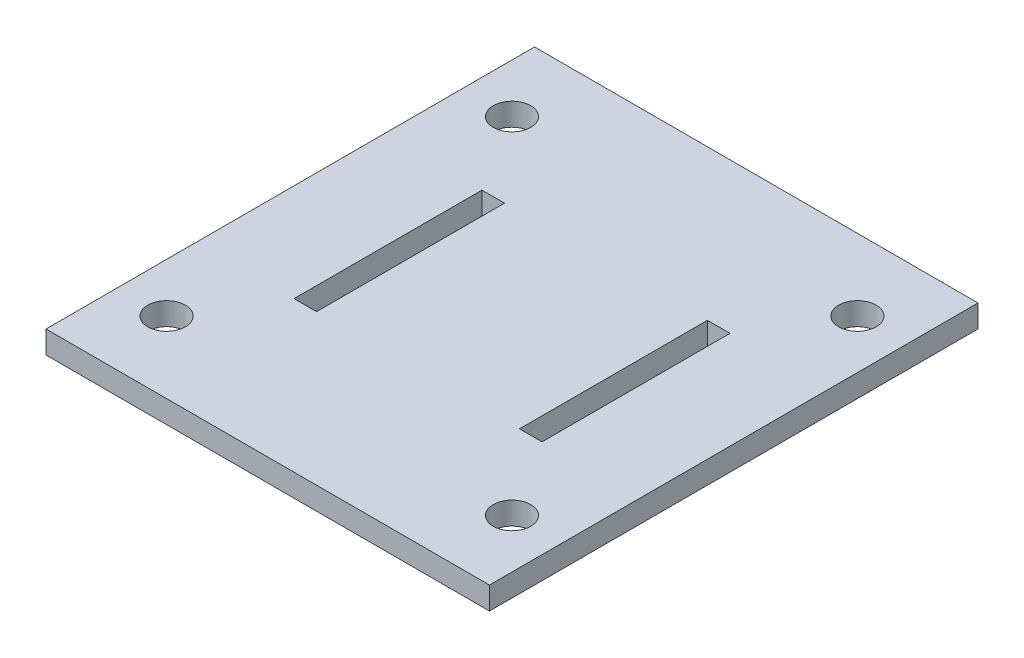
ISO-10303-21;
HEADER;
FILE_DESCRIPTION(('STEP AP214'),'2;1');
FILE_NAME('part.step','',(''),(''),'','','');
FILE_SCHEMA(('AUTOMOTIVE_DESIGN { 1 0 10303 214 1 1 1 1 }'));
ENDSEC;
DATA;
#1=APPLICATION_CONTEXT('core data for automotive mechanical design processes');
#2=APPLICATION_PROTOCOL_DEFINITION('international standard','automotive_design',2000,#1);
#3=PRODUCT_CONTEXT('',#1,'mechanical');
#4=PRODUCT('Part','Part','',(#3));
#5=PRODUCT_RELATED_PRODUCT_CATEGORY('part','',(#4));
#6=PRODUCT_DEFINITION_FORMATION('','',#4);
#7=PRODUCT_DEFINITION_CONTEXT('part definition',#1,'design');
#8=PRODUCT_DEFINITION('design','',#6,#7);
#9=PRODUCT_DEFINITION_SHAPE('','',#8);
#10=(LENGTH_UNIT() NAMED_UNIT(*) SI_UNIT(.MILLI.,.METRE.));
#11=(NAMED_UNIT(*) PLANE_ANGLE_UNIT() SI_UNIT($,.RADIAN.));
#12=(NAMED_UNIT(*) SI_UNIT($,.STERADIAN.) SOLID_ANGLE_UNIT());
#13=UNCERTAINTY_MEASURE_WITH_UNIT(LENGTH_MEASURE(1.E-05),#10,'distance_accuracy_value','');
#14=(GEOMETRIC_REPRESENTATION_CONTEXT(3) GLOBAL_UNCERTAINTY_ASSIGNED_CONTEXT((#13)) GLOBAL_UNIT_ASSIGNED_CONTEXT((#10,
#11,#12)) REPRESENTATION_CONTEXT('',''));
#15=CARTESIAN_POINT('',(0.,0.,0.));
#16=DIRECTION('',(0.,0.,1.));
#17=DIRECTION('',(1.,0.,0.));
#18=AXIS2_PLACEMENT_3D('',#15,#16,#17);
#19=CARTESIAN_POINT('',(29.5,3.,0.));
#20=DIRECTION('',(-1.,0.,0.));
#21=DIRECTION('',(0.,0.,1.));
#22=AXIS2_PLACEMENT_3D('',#19,#20,#21);
#23=PLANE('',#22);
#24=DIRECTION('',(0.,0.,-1.));
#25=VECTOR('',#24,1.);
#26=CARTESIAN_POINT('',(29.5,0.,0.));
#27=LINE('',#26,#25);
#28=CARTESIAN_POINT('',(29.5,0.,32.5));
#29=VERTEX_POINT('',#28);
#30=CARTESIAN_POINT('',(29.5,0.,-32.5));
#31=VERTEX_POINT('',#30);
#32=EDGE_CURVE('E192',#29,#31,#27,.T.);
#33=ORIENTED_EDGE('',*,*,#32,.T.);
#34=DIRECTION('',(0.,-1.,0.));
#35=VECTOR('',#34,1.);
#36=CARTESIAN_POINT('',(29.5,3.,-32.5));
#37=LINE('',#36,#35);
#38=CARTESIAN_POINT('',(29.5,3.,-32.5));
#39=VERTEX_POINT('',#38);
#40=EDGE_CURVE('E11',#39,#31,#37,.T.);
#41=ORIENTED_EDGE('',*,*,#40,.F.);
#42=DIRECTION('',(0.,0.,-1.));
#43=VECTOR('',#42,1.);
#44=CARTESIAN_POINT('',(29.5,3.,0.));
#45=LINE('',#44,#43);
#46=CARTESIAN_POINT('',(29.5,3.,32.5));
#47=VERTEX_POINT('',#46);
#48=EDGE_CURVE('E147',#47,#39,#45,.T.);
#49=ORIENTED_EDGE('',*,*,#48,.F.);
#50=DIRECTION('',(0.,-1.,0.));
#51=VECTOR('',#50,1.);
#52=CARTESIAN_POINT('',(29.5,3.,32.5));
#53=LINE('',#52,#51);
#54=EDGE_CURVE('E199',#47,#29,#53,.T.);
#55=ORIENTED_EDGE('',*,*,#54,.T.);
#56=EDGE_LOOP('',(#33,#41,#49,#55));
#57=FACE_BOUND('',#56,.T.);
#58=ADVANCED_FACE('F35',(#57),#23,.F.);
#59=CARTESIAN_POINT('',(0.,3.,-32.5));
#60=DIRECTION('',(0.,0.,-1.));
#61=DIRECTION('',(-1.,0.,0.));
#62=AXIS2_PLACEMENT_3D('',#59,#60,#61);
#63=PLANE('',#62);
#64=DIRECTION('',(1.,0.,0.));
#65=VECTOR('',#64,1.);
#66=CARTESIAN_POINT('',(0.,0.,-32.5));
#67=LINE('',#66,#65);
#68=CARTESIAN_POINT('',(-29.5,0.,-32.5));
#69=VERTEX_POINT('',#68);
#70=EDGE_CURVE('E139',#69,#31,#67,.T.);
#71=ORIENTED_EDGE('',*,*,#70,.F.);
#72=DIRECTION('',(0.,-1.,0.));
#73=VECTOR('',#72,1.);
#74=CARTESIAN_POINT('',(-29.5,3.,-32.5));
#75=LINE('',#74,#73);
#76=CARTESIAN_POINT('',(-29.5,3.,-32.5));
#77=VERTEX_POINT('',#76);
#78=EDGE_CURVE('E45',#77,#69,#75,.T.);
#79=ORIENTED_EDGE('',*,*,#78,.F.);
#80=DIRECTION('',(1.,0.,0.));
#81=VECTOR('',#80,1.);
#82=CARTESIAN_POINT('',(0.,3.,-32.5));
#83=LINE('',#82,#81);
#84=EDGE_CURVE('E137',#77,#39,#83,.T.);
#85=ORIENTED_EDGE('',*,*,#84,.T.);
#86=ORIENTED_EDGE('',*,*,#40,.T.);
#87=EDGE_LOOP('',(#71,#79,#85,#86));
#88=FACE_BOUND('',#87,.T.);
#89=ADVANCED_FACE('F135',(#88),#63,.T.);
#90=CARTESIAN_POINT('',(-29.5,3.,0.));
#91=DIRECTION('',(1.,0.,0.));
#92=DIRECTION('',(0.,0.,-1.));
#93=AXIS2_PLACEMENT_3D('',#90,#91,#92);
#94=PLANE('',#93);
#95=DIRECTION('',(0.,0.,1.));
#96=VECTOR('',#95,1.);
#97=CARTESIAN_POINT('',(-29.5,0.,0.));
#98=LINE('',#97,#96);
#99=CARTESIAN_POINT('',(-29.5,0.,32.5));
#100=VERTEX_POINT('',#99);
#101=EDGE_CURVE('E93',#69,#100,#98,.T.);
#102=ORIENTED_EDGE('',*,*,#101,.T.);
#103=DIRECTION('',(0.,-1.,0.));
#104=VECTOR('',#103,1.);
#105=CARTESIAN_POINT('',(-29.5,3.,32.5));
#106=LINE('',#105,#104);
#107=CARTESIAN_POINT('',(-29.5,3.,32.5));
#108=VERTEX_POINT('',#107);
#109=EDGE_CURVE('E140',#108,#100,#106,.T.);
#110=ORIENTED_EDGE('',*,*,#109,.F.);
#111=DIRECTION('',(0.,0.,1.));
#112=VECTOR('',#111,1.);
#113=CARTESIAN_POINT('',(-29.5,3.,0.));
#114=LINE('',#113,#112);
#115=EDGE_CURVE('E142',#77,#108,#114,.T.);
#116=ORIENTED_EDGE('',*,*,#115,.F.);
#117=ORIENTED_EDGE('',*,*,#78,.T.);
#118=EDGE_LOOP('',(#102,#110,#116,#117));
#119=FACE_BOUND('',#118,.T.);
#120=ADVANCED_FACE('F143',(#119),#94,.F.);
#121=CARTESIAN_POINT('',(16.5,3.,0.));
#122=DIRECTION('',(-1.,0.,0.));
#123=DIRECTION('',(0.,0.,1.));
#124=AXIS2_PLACEMENT_3D('',#121,#122,#123);
#125=PLANE('',#124);
#126=DIRECTION('',(0.,0.,-1.));
#127=VECTOR('',#126,1.);
#128=CARTESIAN_POINT('',(16.5,0.,0.));
#129=LINE('',#128,#127);
#130=CARTESIAN_POINT('',(16.5,0.,12.5));
#131=VERTEX_POINT('',#130);
#132=CARTESIAN_POINT('',(16.5,0.,-12.5));
#133=VERTEX_POINT('',#132);
#134=EDGE_CURVE('E180',#131,#133,#129,.T.);
#135=ORIENTED_EDGE('',*,*,#134,.F.);
#136=DIRECTION('',(0.,-1.,0.));
#137=VECTOR('',#136,1.);
#138=CARTESIAN_POINT('',(16.5,3.,12.5));
#139=LINE('',#138,#137);
#140=CARTESIAN_POINT('',(16.5,3.,12.5));
#141=VERTEX_POINT('',#140);
#142=EDGE_CURVE('E201',#141,#131,#139,.T.);
#143=ORIENTED_EDGE('',*,*,#142,.F.);
#144=DIRECTION('',(0.,0.,-1.));
#145=VECTOR('',#144,1.);
#146=CARTESIAN_POINT('',(16.5,3.,0.));
#147=LINE('',#146,#145);
#148=CARTESIAN_POINT('',(16.5,3.,-12.5));
#149=VERTEX_POINT('',#148);
#150=EDGE_CURVE('E237',#141,#149,#147,.T.);
#151=ORIENTED_EDGE('',*,*,#150,.T.);
#152=DIRECTION('',(0.,-1.,0.));
#153=VECTOR('',#152,1.);
#154=CARTESIAN_POINT('',(16.5,3.,-12.5));
#155=LINE('',#154,#153);
#156=EDGE_CURVE('E203',#149,#133,#155,.T.);
#157=ORIENTED_EDGE('',*,*,#156,.T.);
#158=EDGE_LOOP('',(#135,#143,#151,#157));
#159=FACE_BOUND('',#158,.T.);
#160=ADVANCED_FACE('F261',(#159),#125,.T.);
#161=CARTESIAN_POINT('',(0.,3.,12.5));
#162=DIRECTION('',(0.,0.,-1.));
#163=DIRECTION('',(-1.,0.,0.));
#164=AXIS2_PLACEMENT_3D('',#161,#162,#163);
#165=PLANE('',#164);
#166=DIRECTION('',(1.,0.,0.));
#167=VECTOR('',#166,1.);
#168=CARTESIAN_POINT('',(0.,0.,12.5));
#169=LINE('',#168,#167);
#170=CARTESIAN_POINT('',(13.5,0.,12.5));
#171=VERTEX_POINT('',#170);
#172=EDGE_CURVE('E183',#171,#131,#169,.T.);
#173=ORIENTED_EDGE('',*,*,#172,.F.);
#174=DIRECTION('',(0.,-1.,0.));
#175=VECTOR('',#174,1.);
#176=CARTESIAN_POINT('',(13.5,3.,12.5));
#177=LINE('',#176,#175);
#178=CARTESIAN_POINT('',(13.5,3.,12.5));
#179=VERTEX_POINT('',#178);
#180=EDGE_CURVE('E208',#179,#171,#177,.T.);
#181=ORIENTED_EDGE('',*,*,#180,.F.);
#182=DIRECTION('',(1.,0.,0.));
#183=VECTOR('',#182,1.);
#184=CARTESIAN_POINT('',(0.,3.,12.5));
#185=LINE('',#184,#183);
#186=EDGE_CURVE('E247',#179,#141,#185,.T.);
#187=ORIENTED_EDGE('',*,*,#186,.T.);
#188=ORIENTED_EDGE('',*,*,#142,.T.);
#189=EDGE_LOOP('',(#173,#181,#187,#188));
#190=FACE_BOUND('',#189,.T.);
#191=ADVANCED_FACE('F264',(#190),#165,.T.);
#192=CARTESIAN_POINT('',(13.5,3.,0.));
#193=DIRECTION('',(-1.,0.,0.));
#194=DIRECTION('',(0.,0.,1.));
#195=AXIS2_PLACEMENT_3D('',#192,#193,#194);
#196=PLANE('',#195);
#197=DIRECTION('',(0.,0.,-1.));
#198=VECTOR('',#197,1.);
#199=CARTESIAN_POINT('',(13.5,0.,0.));
#200=LINE('',#199,#198);
#201=CARTESIAN_POINT('',(13.5,0.,-12.5));
#202=VERTEX_POINT('',#201);
#203=EDGE_CURVE('E186',#171,#202,#200,.T.);
#204=ORIENTED_EDGE('',*,*,#203,.T.);
#205=DIRECTION('',(0.,-1.,0.));
#206=VECTOR('',#205,1.);
#207=CARTESIAN_POINT('',(13.5,3.,-12.5));
#208=LINE('',#207,#206);
#209=CARTESIAN_POINT('',(13.5,3.,-12.5));
#210=VERTEX_POINT('',#209);
#211=EDGE_CURVE('E205',#210,#202,#208,.T.);
#212=ORIENTED_EDGE('',*,*,#211,.F.);
#213=DIRECTION('',(0.,0.,-1.));
#214=VECTOR('',#213,1.);
#215=CARTESIAN_POINT('',(13.5,3.,0.));
#216=LINE('',#215,#214);
#217=EDGE_CURVE('E250',#179,#210,#216,.T.);
#218=ORIENTED_EDGE('',*,*,#217,.F.);
#219=ORIENTED_EDGE('',*,*,#180,.T.);
#220=EDGE_LOOP('',(#204,#212,#218,#219));
#221=FACE_BOUND('',#220,.T.);
#222=ADVANCED_FACE('F267',(#221),#196,.F.);
#223=CARTESIAN_POINT('',(-13.5,3.,0.));
#224=DIRECTION('',(-1.,0.,0.));
#225=DIRECTION('',(0.,0.,1.));
#226=AXIS2_PLACEMENT_3D('',#223,#224,#225);
#227=PLANE('',#226);
#228=DIRECTION('',(0.,0.,-1.));
#229=VECTOR('',#228,1.);
#230=CARTESIAN_POINT('',(-13.5,0.,0.));
#231=LINE('',#230,#229);
#232=CARTESIAN_POINT('',(-13.5,0.,12.5));
#233=VERTEX_POINT('',#232);
#234=CARTESIAN_POINT('',(-13.5,0.,-12.5));
#235=VERTEX_POINT('',#234);
#236=EDGE_CURVE('E168',#233,#235,#231,.T.);
#237=ORIENTED_EDGE('',*,*,#236,.F.);
#238=DIRECTION('',(0.,-1.,0.));
#239=VECTOR('',#238,1.);
#240=CARTESIAN_POINT('',(-13.5,3.,12.5));
#241=LINE('',#240,#239);
#242=CARTESIAN_POINT('',(-13.5,3.,12.5));
#243=VERTEX_POINT('',#242);
#244=EDGE_CURVE('E39',#243,#233,#241,.T.);
#245=ORIENTED_EDGE('',*,*,#244,.F.);
#246=DIRECTION('',(0.,0.,-1.));
#247=VECTOR('',#246,1.);
#248=CARTESIAN_POINT('',(-13.5,3.,0.));
#249=LINE('',#248,#247);
#250=CARTESIAN_POINT('',(-13.5,3.,-12.5));
#251=VERTEX_POINT('',#250);
#252=EDGE_CURVE('E241',#243,#251,#249,.T.);
#253=ORIENTED_EDGE('',*,*,#252,.T.);
#254=DIRECTION('',(0.,-1.,0.));
#255=VECTOR('',#254,1.);
#256=CARTESIAN_POINT('',(-13.5,3.,-12.5));
#257=LINE('',#256,#255);
#258=EDGE_CURVE('E155',#251,#235,#257,.T.);
#259=ORIENTED_EDGE('',*,*,#258,.T.);
#260=EDGE_LOOP('',(#237,#245,#253,#259));
#261=FACE_BOUND('',#260,.T.);
#262=ADVANCED_FACE('F224',(#261),#227,.T.);
#263=CARTESIAN_POINT('',(0.,3.,12.5));
#264=DIRECTION('',(0.,0.,-1.));
#265=DIRECTION('',(-1.,0.,0.));
#266=AXIS2_PLACEMENT_3D('',#263,#264,#265);
#267=PLANE('',#266);
#268=DIRECTION('',(1.,0.,0.));
#269=VECTOR('',#268,1.);
#270=CARTESIAN_POINT('',(0.,0.,12.5));
#271=LINE('',#270,#269);
#272=CARTESIAN_POINT('',(-16.5,0.,12.5));
#273=VERTEX_POINT('',#272);
#274=EDGE_CURVE('E171',#273,#233,#271,.T.);
#275=ORIENTED_EDGE('',*,*,#274,.F.);
#276=DIRECTION('',(0.,-1.,0.));
#277=VECTOR('',#276,1.);
#278=CARTESIAN_POINT('',(-16.5,3.,12.5));
#279=LINE('',#278,#277);
#280=CARTESIAN_POINT('',(-16.5,3.,12.5));
#281=VERTEX_POINT('',#280);
#282=EDGE_CURVE('E214',#281,#273,#279,.T.);
#283=ORIENTED_EDGE('',*,*,#282,.F.);
#284=DIRECTION('',(1.,0.,0.));
#285=VECTOR('',#284,1.);
#286=CARTESIAN_POINT('',(0.,3.,12.5));
#287=LINE('',#286,#285);
#288=EDGE_CURVE('E223',#281,#243,#287,.T.);
#289=ORIENTED_EDGE('',*,*,#288,.T.);
#290=ORIENTED_EDGE('',*,*,#244,.T.);
#291=EDGE_LOOP('',(#275,#283,#289,#290));
#292=FACE_BOUND('',#291,.T.);
#293=ADVANCED_FACE('F221',(#292),#267,.T.);
#294=CARTESIAN_POINT('',(-16.5,3.,0.));
#295=DIRECTION('',(-1.,0.,0.));
#296=DIRECTION('',(0.,0.,1.));
#297=AXIS2_PLACEMENT_3D('',#294,#295,#296);
#298=PLANE('',#297);
#299=DIRECTION('',(0.,0.,-1.));
#300=VECTOR('',#299,1.);
#301=CARTESIAN_POINT('',(-16.5,0.,0.));
#302=LINE('',#301,#300);
#303=CARTESIAN_POINT('',(-16.5,0.,-12.5));
#304=VERTEX_POINT('',#303);
#305=EDGE_CURVE('E174',#273,#304,#302,.T.);
#306=ORIENTED_EDGE('',*,*,#305,.T.);
#307=DIRECTION('',(0.,-1.,0.));
#308=VECTOR('',#307,1.);
#309=CARTESIAN_POINT('',(-16.5,3.,-12.5));
#310=LINE('',#309,#308);
#311=CARTESIAN_POINT('',(-16.5,3.,-12.5));
#312=VERTEX_POINT('',#311);
#313=EDGE_CURVE('E212',#312,#304,#310,.T.);
#314=ORIENTED_EDGE('',*,*,#313,.F.);
#315=DIRECTION('',(0.,0.,-1.));
#316=VECTOR('',#315,1.);
#317=CARTESIAN_POINT('',(-16.5,3.,0.));
#318=LINE('',#317,#316);
#319=EDGE_CURVE('E232',#281,#312,#318,.T.);
#320=ORIENTED_EDGE('',*,*,#319,.F.);
#321=ORIENTED_EDGE('',*,*,#282,.T.);
#322=EDGE_LOOP('',(#306,#314,#320,#321));
#323=FACE_BOUND('',#322,.T.);
#324=ADVANCED_FACE('F230',(#323),#298,.F.);
#325=CARTESIAN_POINT('',(0.,3.,-12.5));
#326=DIRECTION('',(0.,0.,-1.));
#327=DIRECTION('',(-1.,0.,0.));
#328=AXIS2_PLACEMENT_3D('',#325,#326,#327);
#329=PLANE('',#328);
#330=DIRECTION('',(1.,0.,0.));
#331=VECTOR('',#330,1.);
#332=CARTESIAN_POINT('',(0.,0.,-12.5));
#333=LINE('',#332,#331);
#334=EDGE_CURVE('E189',#202,#133,#333,.T.);
#335=ORIENTED_EDGE('',*,*,#334,.T.);
#336=ORIENTED_EDGE('',*,*,#156,.F.);
#337=DIRECTION('',(1.,0.,0.));
#338=VECTOR('',#337,1.);
#339=CARTESIAN_POINT('',(0.,3.,-12.5));
#340=LINE('',#339,#338);
#341=EDGE_CURVE('E150',#210,#149,#340,.T.);
#342=ORIENTED_EDGE('',*,*,#341,.F.);
#343=ORIENTED_EDGE('',*,*,#211,.T.);
#344=EDGE_LOOP('',(#335,#336,#342,#343));
#345=FACE_BOUND('',#344,.T.);
#346=ADVANCED_FACE('F258',(#345),#329,.F.);
#347=CARTESIAN_POINT('',(0.,3.,-12.5));
#348=DIRECTION('',(0.,0.,-1.));
#349=DIRECTION('',(-1.,0.,0.));
#350=AXIS2_PLACEMENT_3D('',#347,#348,#349);
#351=PLANE('',#350);
#352=DIRECTION('',(1.,0.,0.));
#353=VECTOR('',#352,1.);
#354=CARTESIAN_POINT('',(0.,0.,-12.5));
#355=LINE('',#354,#353);
#356=EDGE_CURVE('E177',#304,#235,#355,.T.);
#357=ORIENTED_EDGE('',*,*,#356,.T.);
#358=ORIENTED_EDGE('',*,*,#258,.F.);
#359=DIRECTION('',(1.,0.,0.));
#360=VECTOR('',#359,1.);
#361=CARTESIAN_POINT('',(0.,3.,-12.5));
#362=LINE('',#361,#360);
#363=EDGE_CURVE('E235',#312,#251,#362,.T.);
#364=ORIENTED_EDGE('',*,*,#363,.F.);
#365=ORIENTED_EDGE('',*,*,#313,.T.);
#366=EDGE_LOOP('',(#357,#358,#364,#365));
#367=FACE_BOUND('',#366,.T.);
#368=ADVANCED_FACE('F234',(#367),#351,.F.);
#369=CARTESIAN_POINT('',(22.9809703885628,3.,22.9809703885628));
#370=DIRECTION('',(0.,-1.,0.));
#371=DIRECTION('',(0.,0.,-1.));
#372=AXIS2_PLACEMENT_3D('',#369,#370,#371);
#373=CYLINDRICAL_SURFACE('',#372,2.5);
#374=CARTESIAN_POINT('',(22.9809703885628,3.,22.9809703885628));
#375=DIRECTION('',(0.,1.,0.));
#376=DIRECTION('',(0.,0.,1.));
#377=AXIS2_PLACEMENT_3D('',#374,#375,#376);
#378=CIRCLE('',#377,2.5);
#379=CARTESIAN_POINT('',(22.9809703885628,3.,25.4809703885628));
#380=VERTEX_POINT('',#379);
#381=EDGE_CURVE('E336',#380,#380,#378,.T.);
#382=ORIENTED_EDGE('',*,*,#381,.T.);
#383=EDGE_LOOP('',(#382));
#384=FACE_BOUND('',#383,.T.);
#385=CARTESIAN_POINT('',(22.9809703885628,0.,22.9809703885628));
#386=DIRECTION('',(0.,1.,0.));
#387=DIRECTION('',(0.,0.,1.));
#388=AXIS2_PLACEMENT_3D('',#385,#386,#387);
#389=CIRCLE('',#388,2.5);
#390=CARTESIAN_POINT('',(22.9809703885628,0.,25.4809703885628));
#391=VERTEX_POINT('',#390);
#392=EDGE_CURVE('E165',#391,#391,#389,.T.);
#393=ORIENTED_EDGE('',*,*,#392,.F.);
#394=EDGE_LOOP('',(#393));
#395=FACE_BOUND('',#394,.T.);
#396=ADVANCED_FACE('F303',(#384,#395),#373,.F.);
#397=CARTESIAN_POINT('',(-22.9809703885628,3.,22.9809703885628));
#398=DIRECTION('',(0.,-1.,0.));
#399=DIRECTION('',(0.,0.,-1.));
#400=AXIS2_PLACEMENT_3D('',#397,#398,#399);
#401=CYLINDRICAL_SURFACE('',#400,2.5);
#402=CARTESIAN_POINT('',(-22.9809703885628,3.,22.9809703885628));
#403=DIRECTION('',(0.,1.,0.));
#404=DIRECTION('',(0.,0.,1.));
#405=AXIS2_PLACEMENT_3D('',#402,#403,#404);
#406=CIRCLE('',#405,2.5);
#407=CARTESIAN_POINT('',(-22.9809703885628,3.,25.4809703885628));
#408=VERTEX_POINT('',#407);
#409=EDGE_CURVE('E333',#408,#408,#406,.T.);
#410=ORIENTED_EDGE('',*,*,#409,.T.);
#411=EDGE_LOOP('',(#410));
#412=FACE_BOUND('',#411,.T.);
#413=CARTESIAN_POINT('',(-22.9809703885628,0.,22.9809703885628));
#414=DIRECTION('',(0.,1.,0.));
#415=DIRECTION('',(0.,0.,1.));
#416=AXIS2_PLACEMENT_3D('',#413,#414,#415);
#417=CIRCLE('',#416,2.5);
#418=CARTESIAN_POINT('',(-22.9809703885628,0.,25.4809703885628));
#419=VERTEX_POINT('',#418);
#420=EDGE_CURVE('E162',#419,#419,#417,.T.);
#421=ORIENTED_EDGE('',*,*,#420,.F.);
#422=EDGE_LOOP('',(#421));
#423=FACE_BOUND('',#422,.T.);
#424=ADVANCED_FACE('F312',(#412,#423),#401,.F.);
#425=CARTESIAN_POINT('',(-22.9809703885628,3.,-22.9809703885628));
#426=DIRECTION('',(0.,-1.,0.));
#427=DIRECTION('',(0.,0.,-1.));
#428=AXIS2_PLACEMENT_3D('',#425,#426,#427);
#429=CYLINDRICAL_SURFACE('',#428,2.5);
#430=CARTESIAN_POINT('',(-22.9809703885628,3.,-22.9809703885628));
#431=DIRECTION('',(0.,1.,0.));
#432=DIRECTION('',(0.,0.,1.));
#433=AXIS2_PLACEMENT_3D('',#430,#431,#432);
#434=CIRCLE('',#433,2.5);
#435=CARTESIAN_POINT('',(-22.9809703885628,3.,-20.4809703885628));
#436=VERTEX_POINT('',#435);
#437=EDGE_CURVE('E323',#436,#436,#434,.T.);
#438=ORIENTED_EDGE('',*,*,#437,.T.);
#439=EDGE_LOOP('',(#438));
#440=FACE_BOUND('',#439,.T.);
#441=CARTESIAN_POINT('',(-22.9809703885628,0.,-22.9809703885628));
#442=DIRECTION('',(0.,1.,0.));
#443=DIRECTION('',(0.,0.,1.));
#444=AXIS2_PLACEMENT_3D('',#441,#442,#443);
#445=CIRCLE('',#444,2.5);
#446=CARTESIAN_POINT('',(-22.9809703885628,0.,-20.4809703885628));
#447=VERTEX_POINT('',#446);
#448=EDGE_CURVE('E159',#447,#447,#445,.T.);
#449=ORIENTED_EDGE('',*,*,#448,.F.);
#450=EDGE_LOOP('',(#449));
#451=FACE_BOUND('',#450,.T.);
#452=ADVANCED_FACE('F283',(#440,#451),#429,.F.);
#453=CARTESIAN_POINT('',(22.9809703885628,3.,-22.9809703885628));
#454=DIRECTION('',(0.,-1.,0.));
#455=DIRECTION('',(0.,0.,-1.));
#456=AXIS2_PLACEMENT_3D('',#453,#454,#455);
#457=CYLINDRICAL_SURFACE('',#456,2.5);
#458=CARTESIAN_POINT('',(22.9809703885628,3.,-22.9809703885628));
#459=DIRECTION('',(0.,1.,0.));
#460=DIRECTION('',(0.,0.,1.));
#461=AXIS2_PLACEMENT_3D('',#458,#459,#460);
#462=CIRCLE('',#461,2.5);
#463=CARTESIAN_POINT('',(22.9809703885628,3.,-20.4809703885628));
#464=VERTEX_POINT('',#463);
#465=EDGE_CURVE('E198',#464,#464,#462,.T.);
#466=ORIENTED_EDGE('',*,*,#465,.T.);
#467=EDGE_LOOP('',(#466));
#468=FACE_BOUND('',#467,.T.);
#469=CARTESIAN_POINT('',(22.9809703885628,0.,-22.9809703885628));
#470=DIRECTION('',(0.,1.,0.));
#471=DIRECTION('',(0.,0.,1.));
#472=AXIS2_PLACEMENT_3D('',#469,#470,#471);
#473=CIRCLE('',#472,2.5);
#474=CARTESIAN_POINT('',(22.9809703885628,0.,-20.4809703885628));
#475=VERTEX_POINT('',#474);
#476=EDGE_CURVE('E156',#475,#475,#473,.T.);
#477=ORIENTED_EDGE('',*,*,#476,.F.);
#478=EDGE_LOOP('',(#477));
#479=FACE_BOUND('',#478,.T.);
#480=ADVANCED_FACE('F37',(#468,#479),#457,.F.);
#481=CARTESIAN_POINT('',(0.,3.,32.5));
#482=DIRECTION('',(0.,0.,-1.));
#483=DIRECTION('',(-1.,0.,0.));
#484=AXIS2_PLACEMENT_3D('',#481,#482,#483);
#485=PLANE('',#484);
#486=DIRECTION('',(1.,0.,0.));
#487=VECTOR('',#486,1.);
#488=CARTESIAN_POINT('',(0.,0.,32.5));
#489=LINE('',#488,#487);
#490=EDGE_CURVE('E99',#100,#29,#489,.T.);
#491=ORIENTED_EDGE('',*,*,#490,.T.);
#492=ORIENTED_EDGE('',*,*,#54,.F.);
#493=DIRECTION('',(1.,0.,0.));
#494=VECTOR('',#493,1.);
#495=CARTESIAN_POINT('',(0.,3.,32.5));
#496=LINE('',#495,#494);
#497=EDGE_CURVE('E54',#108,#47,#496,.T.);
#498=ORIENTED_EDGE('',*,*,#497,.F.);
#499=ORIENTED_EDGE('',*,*,#109,.T.);
#500=EDGE_LOOP('',(#491,#492,#498,#499));
#501=FACE_BOUND('',#500,.T.);
#502=ADVANCED_FACE('F274',(#501),#485,.F.);
#503=CARTESIAN_POINT('',(0.,3.,0.));
#504=DIRECTION('',(0.,1.,0.));
#505=DIRECTION('',(0.,0.,1.));
#506=AXIS2_PLACEMENT_3D('',#503,#504,#505);
#507=PLANE('',#506);
#508=ORIENTED_EDGE('',*,*,#465,.F.);
#509=EDGE_LOOP('',(#508));
#510=FACE_BOUND('',#509,.T.);
#511=ORIENTED_EDGE('',*,*,#437,.F.);
#512=EDGE_LOOP('',(#511));
#513=FACE_BOUND('',#512,.T.);
#514=ORIENTED_EDGE('',*,*,#409,.F.);
#515=EDGE_LOOP('',(#514));
#516=FACE_BOUND('',#515,.T.);
#517=ORIENTED_EDGE('',*,*,#381,.F.);
#518=EDGE_LOOP('',(#517));
#519=FACE_BOUND('',#518,.T.);
#520=ORIENTED_EDGE('',*,*,#252,.F.);
#521=ORIENTED_EDGE('',*,*,#288,.F.);
#522=ORIENTED_EDGE('',*,*,#319,.T.);
#523=ORIENTED_EDGE('',*,*,#363,.T.);
#524=EDGE_LOOP('',(#520,#521,#522,#523));
#525=FACE_BOUND('',#524,.T.);
#526=ORIENTED_EDGE('',*,*,#150,.F.);
#527=ORIENTED_EDGE('',*,*,#186,.F.);
#528=ORIENTED_EDGE('',*,*,#217,.T.);
#529=ORIENTED_EDGE('',*,*,#341,.T.);
#530=EDGE_LOOP('',(#526,#527,#528,#529));
#531=FACE_BOUND('',#530,.T.);
#532=ORIENTED_EDGE('',*,*,#48,.T.);
#533=ORIENTED_EDGE('',*,*,#84,.F.);
#534=ORIENTED_EDGE('',*,*,#115,.T.);
#535=ORIENTED_EDGE('',*,*,#497,.T.);
#536=EDGE_LOOP('',(#532,#533,#534,#535));
#537=FACE_BOUND('',#536,.T.);
#538=ADVANCED_FACE('F145',(#510,#513,#516,#519,#525,#531,#537),#507,.T.);
#539=CARTESIAN_POINT('',(0.,0.,0.));
#540=DIRECTION('',(0.,1.,0.));
#541=DIRECTION('',(0.,0.,1.));
#542=AXIS2_PLACEMENT_3D('',#539,#540,#541);
#543=PLANE('',#542);
#544=ORIENTED_EDGE('',*,*,#476,.T.);
#545=EDGE_LOOP('',(#544));
#546=FACE_BOUND('',#545,.T.);
#547=ORIENTED_EDGE('',*,*,#448,.T.);
#548=EDGE_LOOP('',(#547));
#549=FACE_BOUND('',#548,.T.);
#550=ORIENTED_EDGE('',*,*,#420,.T.);
#551=EDGE_LOOP('',(#550));
#552=FACE_BOUND('',#551,.T.);
#553=ORIENTED_EDGE('',*,*,#392,.T.);
#554=EDGE_LOOP('',(#553));
#555=FACE_BOUND('',#554,.T.);
#556=ORIENTED_EDGE('',*,*,#236,.T.);
#557=ORIENTED_EDGE('',*,*,#356,.F.);
#558=ORIENTED_EDGE('',*,*,#305,.F.);
#559=ORIENTED_EDGE('',*,*,#274,.T.);
#560=EDGE_LOOP('',(#556,#557,#558,#559));
#561=FACE_BOUND('',#560,.T.);
#562=ORIENTED_EDGE('',*,*,#134,.T.);
#563=ORIENTED_EDGE('',*,*,#334,.F.);
#564=ORIENTED_EDGE('',*,*,#203,.F.);
#565=ORIENTED_EDGE('',*,*,#172,.T.);
#566=EDGE_LOOP('',(#562,#563,#564,#565));
#567=FACE_BOUND('',#566,.T.);
#568=ORIENTED_EDGE('',*,*,#32,.F.);
#569=ORIENTED_EDGE('',*,*,#490,.F.);
#570=ORIENTED_EDGE('',*,*,#101,.F.);
#571=ORIENTED_EDGE('',*,*,#70,.T.);
#572=EDGE_LOOP('',(#568,#569,#570,#571));
#573=FACE_BOUND('',#572,.T.);
#574=ADVANCED_FACE('F227',(#546,#549,#552,#555,#561,#567,#573),#543,.F.);
#575=CLOSED_SHELL('',(#58,#89,#120,#160,#191,#222,#262,#293,#324,#346,#368,#396,#424,#452,#480,
#502,#538,#574));
#576=MANIFOLD_SOLID_BREP('B2',#575);
#577=ADVANCED_BREP_SHAPE_REPRESENTATION('',(#18,#576),#14);
#578=SHAPE_DEFINITION_REPRESENTATION(#9,#577);
ENDSEC;
END-ISO-10303-21;
